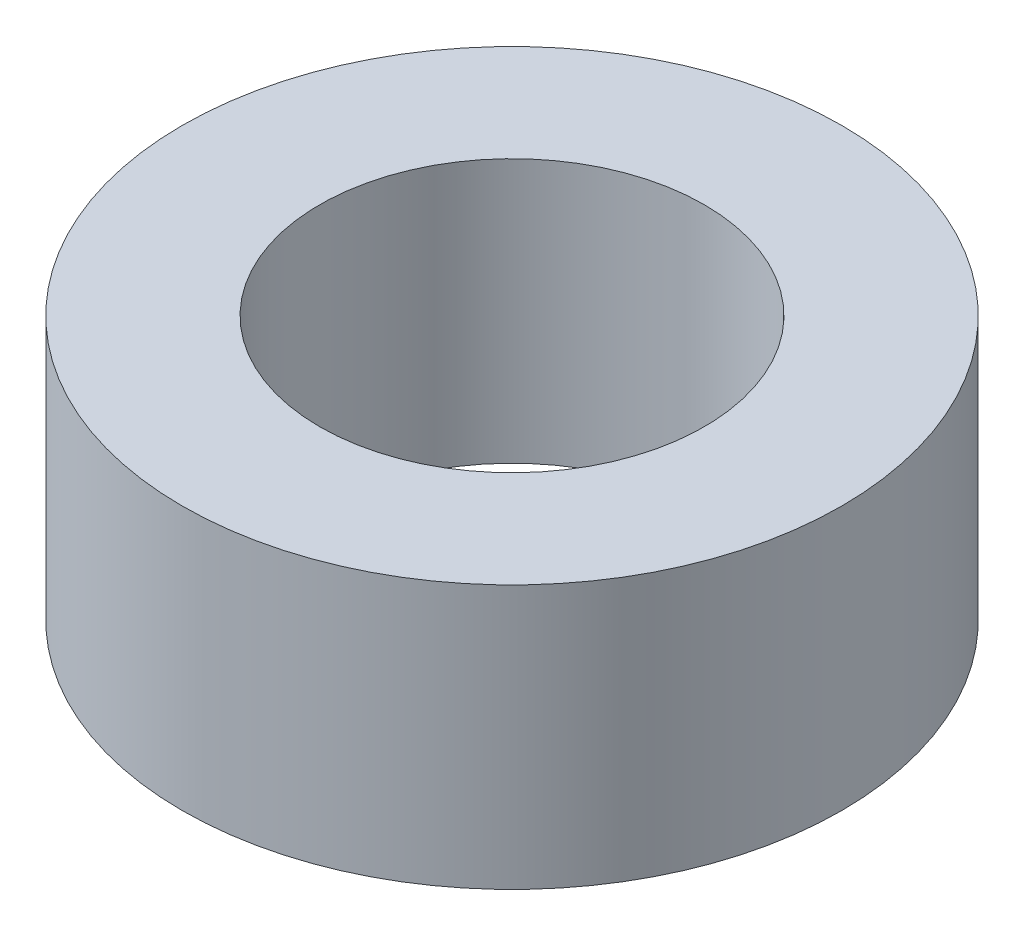
ISO-10303-21;
HEADER;
FILE_DESCRIPTION(('STEP AP214'),'2;1');
FILE_NAME('part.step','',(''),(''),'','','');
FILE_SCHEMA(('AUTOMOTIVE_DESIGN { 1 0 10303 214 1 1 1 1 }'));
ENDSEC;
DATA;
#1=APPLICATION_CONTEXT('core data for automotive mechanical design processes');
#2=APPLICATION_PROTOCOL_DEFINITION('international standard','automotive_design',2000,#1);
#3=PRODUCT_CONTEXT('',#1,'mechanical');
#4=PRODUCT('Part','Part','',(#3));
#5=PRODUCT_RELATED_PRODUCT_CATEGORY('part','',(#4));
#6=PRODUCT_DEFINITION_FORMATION('','',#4);
#7=PRODUCT_DEFINITION_CONTEXT('part definition',#1,'design');
#8=PRODUCT_DEFINITION('design','',#6,#7);
#9=PRODUCT_DEFINITION_SHAPE('','',#8);
#10=(LENGTH_UNIT() NAMED_UNIT(*) SI_UNIT(.MILLI.,.METRE.));
#11=(NAMED_UNIT(*) PLANE_ANGLE_UNIT() SI_UNIT($,.RADIAN.));
#12=(NAMED_UNIT(*) SI_UNIT($,.STERADIAN.) SOLID_ANGLE_UNIT());
#13=UNCERTAINTY_MEASURE_WITH_UNIT(LENGTH_MEASURE(1.E-05),#10,'distance_accuracy_value','');
#14=(GEOMETRIC_REPRESENTATION_CONTEXT(3) GLOBAL_UNCERTAINTY_ASSIGNED_CONTEXT((#13)) GLOBAL_UNIT_ASSIGNED_CONTEXT((#10,
#11,#12)) REPRESENTATION_CONTEXT('',''));
#15=CARTESIAN_POINT('',(0.,0.,0.));
#16=DIRECTION('',(0.,0.,1.));
#17=DIRECTION('',(1.,0.,0.));
#18=AXIS2_PLACEMENT_3D('',#15,#16,#17);
#19=CARTESIAN_POINT('',(0.,24.,0.));
#20=DIRECTION('',(0.,-1.,0.));
#21=DIRECTION('',(0.,0.,-1.));
#22=AXIS2_PLACEMENT_3D('',#19,#20,#21);
#23=CYLINDRICAL_SURFACE('',#22,30.);
#24=CARTESIAN_POINT('',(0.,24.,0.));
#25=DIRECTION('',(0.,1.,0.));
#26=DIRECTION('',(0.,0.,1.));
#27=AXIS2_PLACEMENT_3D('',#24,#25,#26);
#28=CIRCLE('',#27,30.);
#29=CARTESIAN_POINT('',(0.,24.,30.));
#30=VERTEX_POINT('',#29);
#31=EDGE_CURVE('E10',#30,#30,#28,.T.);
#32=ORIENTED_EDGE('',*,*,#31,.F.);
#33=EDGE_LOOP('',(#32));
#34=FACE_BOUND('',#33,.T.);
#35=CARTESIAN_POINT('',(0.,0.,0.));
#36=DIRECTION('',(0.,1.,0.));
#37=DIRECTION('',(0.,0.,1.));
#38=AXIS2_PLACEMENT_3D('',#35,#36,#37);
#39=CIRCLE('',#38,30.);
#40=CARTESIAN_POINT('',(0.,0.,30.));
#41=VERTEX_POINT('',#40);
#42=EDGE_CURVE('E37',#41,#41,#39,.T.);
#43=ORIENTED_EDGE('',*,*,#42,.T.);
#44=EDGE_LOOP('',(#43));
#45=FACE_BOUND('',#44,.T.);
#46=ADVANCED_FACE('F40',(#34,#45),#23,.T.);
#47=CARTESIAN_POINT('',(0.,24.,0.));
#48=DIRECTION('',(0.,1.,0.));
#49=DIRECTION('',(0.,0.,1.));
#50=AXIS2_PLACEMENT_3D('',#47,#48,#49);
#51=PLANE('',#50);
#52=CARTESIAN_POINT('',(0.,24.,0.));
#53=DIRECTION('',(0.,1.,0.));
#54=DIRECTION('',(0.,0.,1.));
#55=AXIS2_PLACEMENT_3D('',#52,#53,#54);
#56=CIRCLE('',#55,17.5);
#57=CARTESIAN_POINT('',(0.,24.,17.5));
#58=VERTEX_POINT('',#57);
#59=EDGE_CURVE('E50',#58,#58,#56,.T.);
#60=ORIENTED_EDGE('',*,*,#59,.F.);
#61=EDGE_LOOP('',(#60));
#62=FACE_BOUND('',#61,.T.);
#63=ORIENTED_EDGE('',*,*,#31,.T.);
#64=EDGE_LOOP('',(#63));
#65=FACE_BOUND('',#64,.T.);
#66=ADVANCED_FACE('F59',(#62,#65),#51,.T.);
#67=CARTESIAN_POINT('',(0.,0.,0.));
#68=DIRECTION('',(0.,1.,0.));
#69=DIRECTION('',(0.,0.,1.));
#70=AXIS2_PLACEMENT_3D('',#67,#68,#69);
#71=PLANE('',#70);
#72=CARTESIAN_POINT('',(0.,0.,0.));
#73=DIRECTION('',(0.,1.,0.));
#74=DIRECTION('',(0.,0.,1.));
#75=AXIS2_PLACEMENT_3D('',#72,#73,#74);
#76=CIRCLE('',#75,17.5);
#77=CARTESIAN_POINT('',(0.,0.,17.5));
#78=VERTEX_POINT('',#77);
#79=EDGE_CURVE('E47',#78,#78,#76,.T.);
#80=ORIENTED_EDGE('',*,*,#79,.T.);
#81=EDGE_LOOP('',(#80));
#82=FACE_BOUND('',#81,.T.);
#83=ORIENTED_EDGE('',*,*,#42,.F.);
#84=EDGE_LOOP('',(#83));
#85=FACE_BOUND('',#84,.T.);
#86=ADVANCED_FACE('F58',(#82,#85),#71,.F.);
#87=CARTESIAN_POINT('',(0.,24.,0.));
#88=DIRECTION('',(0.,-1.,0.));
#89=DIRECTION('',(0.,0.,-1.));
#90=AXIS2_PLACEMENT_3D('',#87,#88,#89);
#91=CYLINDRICAL_SURFACE('',#90,17.5);
#92=ORIENTED_EDGE('',*,*,#59,.T.);
#93=EDGE_LOOP('',(#92));
#94=FACE_BOUND('',#93,.T.);
#95=ORIENTED_EDGE('',*,*,#79,.F.);
#96=EDGE_LOOP('',(#95));
#97=FACE_BOUND('',#96,.T.);
#98=ADVANCED_FACE('F54',(#94,#97),#91,.F.);
#99=CLOSED_SHELL('',(#46,#66,#86,#98));
#100=MANIFOLD_SOLID_BREP('B2',#99);
#101=ADVANCED_BREP_SHAPE_REPRESENTATION('',(#18,#100),#14);
#102=SHAPE_DEFINITION_REPRESENTATION(#9,#101);
ENDSEC;
END-ISO-10303-21;
